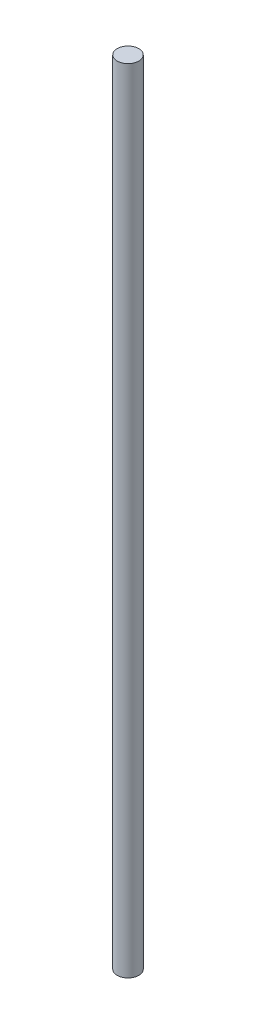
ISO-10303-21;
HEADER;
FILE_DESCRIPTION(('STEP AP214'),'2;1');
FILE_NAME('part.step','',(''),(''),'','','');
FILE_SCHEMA(('AUTOMOTIVE_DESIGN { 1 0 10303 214 1 1 1 1 }'));
ENDSEC;
DATA;
#1=APPLICATION_CONTEXT('core data for automotive mechanical design processes');
#2=APPLICATION_PROTOCOL_DEFINITION('international standard','automotive_design',2000,#1);
#3=PRODUCT_CONTEXT('',#1,'mechanical');
#4=PRODUCT('Part','Part','',(#3));
#5=PRODUCT_RELATED_PRODUCT_CATEGORY('part','',(#4));
#6=PRODUCT_DEFINITION_FORMATION('','',#4);
#7=PRODUCT_DEFINITION_CONTEXT('part definition',#1,'design');
#8=PRODUCT_DEFINITION('design','',#6,#7);
#9=PRODUCT_DEFINITION_SHAPE('','',#8);
#10=(LENGTH_UNIT() NAMED_UNIT(*) SI_UNIT(.MILLI.,.METRE.));
#11=(NAMED_UNIT(*) PLANE_ANGLE_UNIT() SI_UNIT($,.RADIAN.));
#12=(NAMED_UNIT(*) SI_UNIT($,.STERADIAN.) SOLID_ANGLE_UNIT());
#13=UNCERTAINTY_MEASURE_WITH_UNIT(LENGTH_MEASURE(1.E-05),#10,'distance_accuracy_value','');
#14=(GEOMETRIC_REPRESENTATION_CONTEXT(3) GLOBAL_UNCERTAINTY_ASSIGNED_CONTEXT((#13)) GLOBAL_UNIT_ASSIGNED_CONTEXT((#10,
#11,#12)) REPRESENTATION_CONTEXT('',''));
#15=CARTESIAN_POINT('',(0.,0.,0.));
#16=DIRECTION('',(0.,0.,1.));
#17=DIRECTION('',(1.,0.,0.));
#18=AXIS2_PLACEMENT_3D('',#15,#16,#17);
#19=CARTESIAN_POINT('',(0.,349.25,0.));
#20=DIRECTION('',(0.,-1.,0.));
#21=DIRECTION('',(0.,0.,-1.));
#22=AXIS2_PLACEMENT_3D('',#19,#20,#21);
#23=CYLINDRICAL_SURFACE('',#22,4.7625);
#24=CARTESIAN_POINT('',(0.,349.25,0.));
#25=DIRECTION('',(0.,1.,0.));
#26=DIRECTION('',(0.,0.,1.));
#27=AXIS2_PLACEMENT_3D('',#24,#25,#26);
#28=CIRCLE('',#27,4.7625);
#29=CARTESIAN_POINT('',(0.,349.25,4.7625));
#30=VERTEX_POINT('',#29);
#31=EDGE_CURVE('E10',#30,#30,#28,.T.);
#32=ORIENTED_EDGE('',*,*,#31,.F.);
#33=EDGE_LOOP('',(#32));
#34=FACE_BOUND('',#33,.T.);
#35=CARTESIAN_POINT('',(0.,0.,0.));
#36=DIRECTION('',(0.,1.,0.));
#37=DIRECTION('',(0.,0.,1.));
#38=AXIS2_PLACEMENT_3D('',#35,#36,#37);
#39=CIRCLE('',#38,4.7625);
#40=CARTESIAN_POINT('',(0.,0.,4.7625));
#41=VERTEX_POINT('',#40);
#42=EDGE_CURVE('E38',#41,#41,#39,.T.);
#43=ORIENTED_EDGE('',*,*,#42,.T.);
#44=EDGE_LOOP('',(#43));
#45=FACE_BOUND('',#44,.T.);
#46=ADVANCED_FACE('F35',(#34,#45),#23,.T.);
#47=CARTESIAN_POINT('',(0.,349.25,0.));
#48=DIRECTION('',(0.,1.,0.));
#49=DIRECTION('',(0.,0.,1.));
#50=AXIS2_PLACEMENT_3D('',#47,#48,#49);
#51=PLANE('',#50);
#52=ORIENTED_EDGE('',*,*,#31,.T.);
#53=EDGE_LOOP('',(#52));
#54=FACE_BOUND('',#53,.T.);
#55=ADVANCED_FACE('F50',(#54),#51,.T.);
#56=CARTESIAN_POINT('',(0.,0.,0.));
#57=DIRECTION('',(0.,1.,0.));
#58=DIRECTION('',(0.,0.,1.));
#59=AXIS2_PLACEMENT_3D('',#56,#57,#58);
#60=PLANE('',#59);
#61=ORIENTED_EDGE('',*,*,#42,.F.);
#62=EDGE_LOOP('',(#61));
#63=FACE_BOUND('',#62,.T.);
#64=ADVANCED_FACE('F48',(#63),#60,.F.);
#65=CLOSED_SHELL('',(#46,#55,#64));
#66=MANIFOLD_SOLID_BREP('B2',#65);
#67=ADVANCED_BREP_SHAPE_REPRESENTATION('',(#18,#66),#14);
#68=SHAPE_DEFINITION_REPRESENTATION(#9,#67);
ENDSEC;
END-ISO-10303-21;
